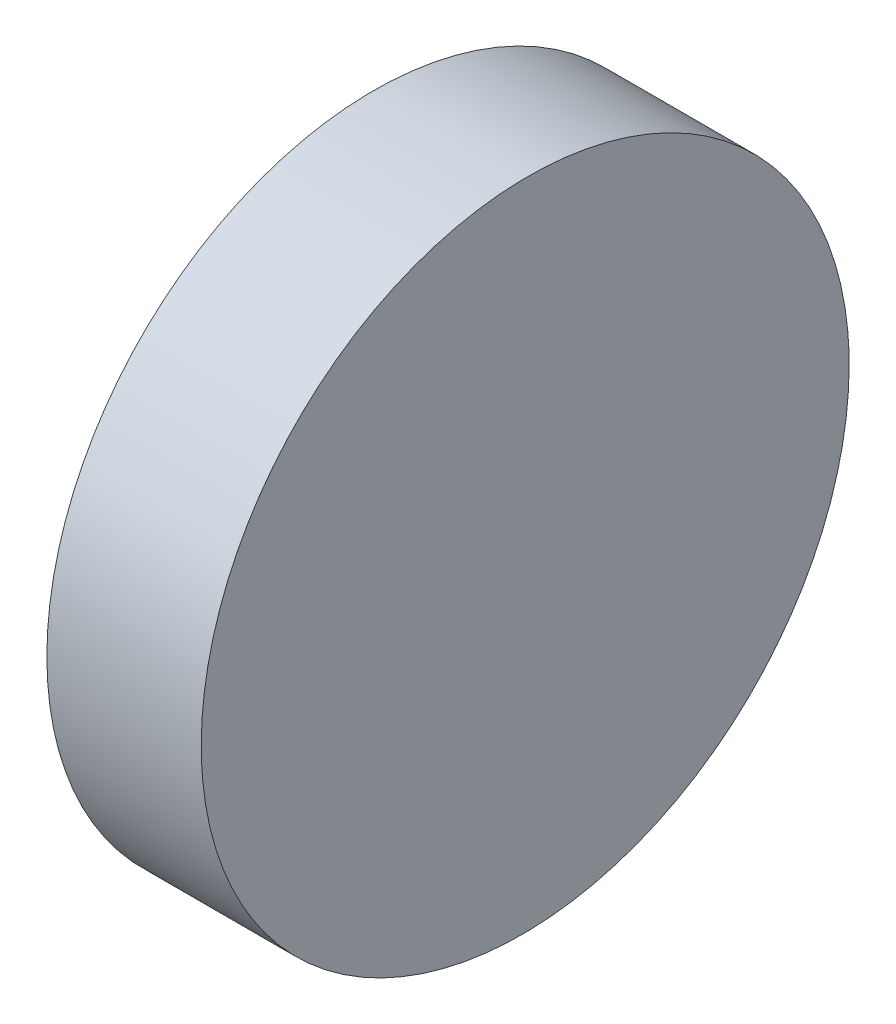
ISO-10303-21;
HEADER;
FILE_DESCRIPTION(('STEP AP214'),'2;1');
FILE_NAME('part.step','',(''),(''),'','','');
FILE_SCHEMA(('AUTOMOTIVE_DESIGN { 1 0 10303 214 1 1 1 1 }'));
ENDSEC;
DATA;
#1=APPLICATION_CONTEXT('core data for automotive mechanical design processes');
#2=APPLICATION_PROTOCOL_DEFINITION('international standard','automotive_design',2000,#1);
#3=PRODUCT_CONTEXT('',#1,'mechanical');
#4=PRODUCT('Part','Part','',(#3));
#5=PRODUCT_RELATED_PRODUCT_CATEGORY('part','',(#4));
#6=PRODUCT_DEFINITION_FORMATION('','',#4);
#7=PRODUCT_DEFINITION_CONTEXT('part definition',#1,'design');
#8=PRODUCT_DEFINITION('design','',#6,#7);
#9=PRODUCT_DEFINITION_SHAPE('','',#8);
#10=(LENGTH_UNIT() NAMED_UNIT(*) SI_UNIT(.MILLI.,.METRE.));
#11=(NAMED_UNIT(*) PLANE_ANGLE_UNIT() SI_UNIT($,.RADIAN.));
#12=(NAMED_UNIT(*) SI_UNIT($,.STERADIAN.) SOLID_ANGLE_UNIT());
#13=UNCERTAINTY_MEASURE_WITH_UNIT(LENGTH_MEASURE(1.E-05),#10,'distance_accuracy_value','');
#14=(GEOMETRIC_REPRESENTATION_CONTEXT(3) GLOBAL_UNCERTAINTY_ASSIGNED_CONTEXT((#13)) GLOBAL_UNIT_ASSIGNED_CONTEXT((#10,
#11,#12)) REPRESENTATION_CONTEXT('',''));
#15=CARTESIAN_POINT('',(0.,0.,0.));
#16=DIRECTION('',(0.,0.,1.));
#17=DIRECTION('',(1.,0.,0.));
#18=AXIS2_PLACEMENT_3D('',#15,#16,#17);
#19=CARTESIAN_POINT('',(0.,12.7,-6.35));
#20=DIRECTION('',(1.,0.,0.));
#21=DIRECTION('',(0.,0.,-1.));
#22=AXIS2_PLACEMENT_3D('',#19,#20,#21);
#23=PLANE('',#22);
#24=CARTESIAN_POINT('',(0.,6.35,0.));
#25=DIRECTION('',(-1.,0.,0.));
#26=DIRECTION('',(0.,0.,1.));
#27=AXIS2_PLACEMENT_3D('',#24,#25,#26);
#28=CIRCLE('',#27,6.35);
#29=CARTESIAN_POINT('',(0.,6.35,6.35));
#30=VERTEX_POINT('',#29);
#31=EDGE_CURVE('E75',#30,#30,#28,.T.);
#32=ORIENTED_EDGE('',*,*,#31,.T.);
#33=EDGE_LOOP('',(#32));
#34=FACE_BOUND('',#33,.T.);
#35=ADVANCED_FACE('F69',(#34),#23,.F.);
#36=CARTESIAN_POINT('',(3.,12.7,6.35));
#37=DIRECTION('',(-0.999961923064172,0.,0.008726535498367));
#38=DIRECTION('',(0.008726535498367,0.,0.999961923064171));
#39=AXIS2_PLACEMENT_3D('',#36,#37,#38);
#40=PLANE('',#39);
#41=CARTESIAN_POINT('',(2.94458438952873,6.35,0.));
#42=DIRECTION('',(-0.999961923064172,0.,0.008726535498367));
#43=DIRECTION('',(-0.008726535498367,0.,-0.999961923064171));
#44=AXIS2_PLACEMENT_3D('',#41,#42,#43);
#45=ELLIPSE('',#44,6.35024179774943,6.35);
#46=CARTESIAN_POINT('',(2.88916877905745,6.35,-6.35));
#47=VERTEX_POINT('',#46);
#48=EDGE_CURVE('E11',#47,#47,#45,.T.);
#49=ORIENTED_EDGE('',*,*,#48,.F.);
#50=EDGE_LOOP('',(#49));
#51=FACE_BOUND('',#50,.T.);
#52=ADVANCED_FACE('F84',(#51),#40,.F.);
#53=CARTESIAN_POINT('',(12.5,6.35,0.));
#54=DIRECTION('',(-1.,0.,0.));
#55=DIRECTION('',(0.,0.,1.));
#56=AXIS2_PLACEMENT_3D('',#53,#54,#55);
#57=CYLINDRICAL_SURFACE('',#56,6.35);
#58=ORIENTED_EDGE('',*,*,#31,.F.);
#59=EDGE_LOOP('',(#58));
#60=FACE_BOUND('',#59,.T.);
#61=ORIENTED_EDGE('',*,*,#48,.T.);
#62=EDGE_LOOP('',(#61));
#63=FACE_BOUND('',#62,.T.);
#64=ADVANCED_FACE('F82',(#60,#63),#57,.T.);
#65=CLOSED_SHELL('',(#35,#52,#64));
#66=MANIFOLD_SOLID_BREP('B2',#65);
#67=ADVANCED_BREP_SHAPE_REPRESENTATION('',(#18,#66),#14);
#68=SHAPE_DEFINITION_REPRESENTATION(#9,#67);
ENDSEC;
END-ISO-10303-21;
